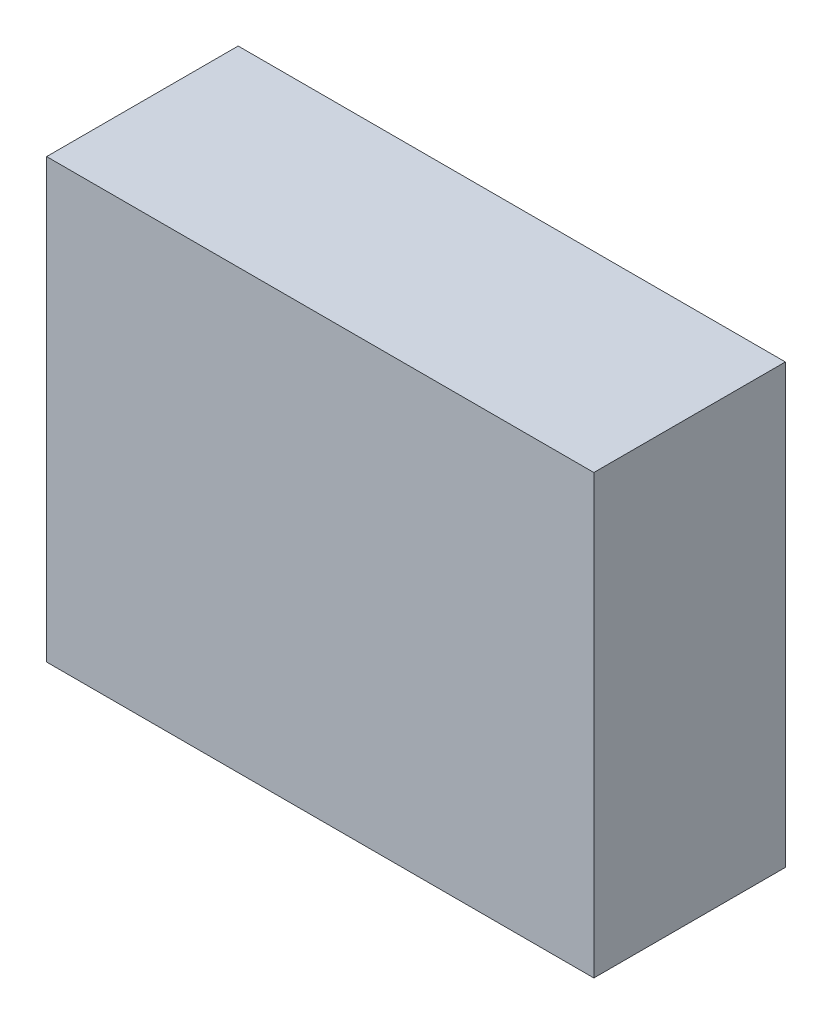
ISO-10303-21;
HEADER;
FILE_DESCRIPTION(('STEP AP214'),'2;1');
FILE_NAME('part.step','',(''),(''),'','','');
FILE_SCHEMA(('AUTOMOTIVE_DESIGN { 1 0 10303 214 1 1 1 1 }'));
ENDSEC;
DATA;
#1=APPLICATION_CONTEXT('core data for automotive mechanical design processes');
#2=APPLICATION_PROTOCOL_DEFINITION('international standard','automotive_design',2000,#1);
#3=PRODUCT_CONTEXT('',#1,'mechanical');
#4=PRODUCT('Part','Part','',(#3));
#5=PRODUCT_RELATED_PRODUCT_CATEGORY('part','',(#4));
#6=PRODUCT_DEFINITION_FORMATION('','',#4);
#7=PRODUCT_DEFINITION_CONTEXT('part definition',#1,'design');
#8=PRODUCT_DEFINITION('design','',#6,#7);
#9=PRODUCT_DEFINITION_SHAPE('','',#8);
#10=(LENGTH_UNIT() NAMED_UNIT(*) SI_UNIT(.MILLI.,.METRE.));
#11=(NAMED_UNIT(*) PLANE_ANGLE_UNIT() SI_UNIT($,.RADIAN.));
#12=(NAMED_UNIT(*) SI_UNIT($,.STERADIAN.) SOLID_ANGLE_UNIT());
#13=UNCERTAINTY_MEASURE_WITH_UNIT(LENGTH_MEASURE(1.E-05),#10,'distance_accuracy_value','');
#14=(GEOMETRIC_REPRESENTATION_CONTEXT(3) GLOBAL_UNCERTAINTY_ASSIGNED_CONTEXT((#13)) GLOBAL_UNIT_ASSIGNED_CONTEXT((#10,
#11,#12)) REPRESENTATION_CONTEXT('',''));
#15=CARTESIAN_POINT('',(0.,0.,0.));
#16=DIRECTION('',(0.,0.,1.));
#17=DIRECTION('',(1.,0.,0.));
#18=AXIS2_PLACEMENT_3D('',#15,#16,#17);
#19=CARTESIAN_POINT('',(2.50000008,2.00000108,1.74999904));
#20=DIRECTION('',(0.,0.,1.));
#21=DIRECTION('',(1.,0.,0.));
#22=AXIS2_PLACEMENT_3D('',#19,#20,#21);
#23=PLANE('',#22);
#24=DIRECTION('',(1.,0.,0.));
#25=VECTOR('',#24,1.);
#26=CARTESIAN_POINT('',(2.50000008,-2.00000108,1.74999904));
#27=LINE('',#26,#25);
#28=CARTESIAN_POINT('',(2.50000008,-2.00000108,1.74999904));
#29=VERTEX_POINT('',#28);
#30=CARTESIAN_POINT('',(-2.50000008,-2.00000108,1.74999904));
#31=VERTEX_POINT('',#30);
#32=EDGE_CURVE('E52',#29,#31,#27,.F.);
#33=ORIENTED_EDGE('',*,*,#32,.F.);
#34=DIRECTION('',(0.,1.,0.));
#35=VECTOR('',#34,1.);
#36=CARTESIAN_POINT('',(2.50000008,2.00000108,1.74999904));
#37=LINE('',#36,#35);
#38=CARTESIAN_POINT('',(2.50000008,2.00000108,1.74999904));
#39=VERTEX_POINT('',#38);
#40=EDGE_CURVE('E67',#39,#29,#37,.F.);
#41=ORIENTED_EDGE('',*,*,#40,.F.);
#42=DIRECTION('',(1.,0.,0.));
#43=VECTOR('',#42,1.);
#44=CARTESIAN_POINT('',(-2.50000008,2.00000108,1.74999904));
#45=LINE('',#44,#43);
#46=CARTESIAN_POINT('',(-2.50000008,2.00000108,1.74999904));
#47=VERTEX_POINT('',#46);
#48=EDGE_CURVE('E19',#47,#39,#45,.T.);
#49=ORIENTED_EDGE('',*,*,#48,.F.);
#50=DIRECTION('',(0.,1.,0.));
#51=VECTOR('',#50,1.);
#52=CARTESIAN_POINT('',(-2.50000008,-2.00000108,1.74999904));
#53=LINE('',#52,#51);
#54=EDGE_CURVE('E57',#31,#47,#53,.T.);
#55=ORIENTED_EDGE('',*,*,#54,.F.);
#56=EDGE_LOOP('',(#33,#41,#49,#55));
#57=FACE_BOUND('',#56,.T.);
#58=ADVANCED_FACE('F16',(#57),#23,.T.);
#59=CARTESIAN_POINT('',(-2.50000008,2.00000108,0.));
#60=DIRECTION('',(0.,1.,0.));
#61=DIRECTION('',(0.,0.,1.));
#62=AXIS2_PLACEMENT_3D('',#59,#60,#61);
#63=PLANE('',#62);
#64=DIRECTION('',(0.,0.,-1.));
#65=VECTOR('',#64,1.);
#66=CARTESIAN_POINT('',(2.50000008,2.00000108,0.));
#67=LINE('',#66,#65);
#68=CARTESIAN_POINT('',(2.50000008,2.00000108,0.));
#69=VERTEX_POINT('',#68);
#70=EDGE_CURVE('E78',#69,#39,#67,.F.);
#71=ORIENTED_EDGE('',*,*,#70,.F.);
#72=DIRECTION('',(1.,0.,0.));
#73=VECTOR('',#72,1.);
#74=CARTESIAN_POINT('',(2.50000008,2.00000108,0.));
#75=LINE('',#74,#73);
#76=CARTESIAN_POINT('',(-2.50000008,2.00000108,0.));
#77=VERTEX_POINT('',#76);
#78=EDGE_CURVE('E73',#69,#77,#75,.F.);
#79=ORIENTED_EDGE('',*,*,#78,.T.);
#80=DIRECTION('',(0.,0.,1.));
#81=VECTOR('',#80,1.);
#82=CARTESIAN_POINT('',(-2.50000008,2.00000108,0.));
#83=LINE('',#82,#81);
#84=EDGE_CURVE('E62',#47,#77,#83,.F.);
#85=ORIENTED_EDGE('',*,*,#84,.F.);
#86=ORIENTED_EDGE('',*,*,#48,.T.);
#87=EDGE_LOOP('',(#71,#79,#85,#86));
#88=FACE_BOUND('',#87,.T.);
#89=ADVANCED_FACE('F72',(#88),#63,.T.);
#90=CARTESIAN_POINT('',(-2.50000008,-2.00000108,0.));
#91=DIRECTION('',(-1.,0.,0.));
#92=DIRECTION('',(0.,0.,1.));
#93=AXIS2_PLACEMENT_3D('',#90,#91,#92);
#94=PLANE('',#93);
#95=ORIENTED_EDGE('',*,*,#84,.T.);
#96=DIRECTION('',(0.,1.,0.));
#97=VECTOR('',#96,1.);
#98=CARTESIAN_POINT('',(-2.50000008,2.00000108,0.));
#99=LINE('',#98,#97);
#100=CARTESIAN_POINT('',(-2.50000008,-2.00000108,0.));
#101=VERTEX_POINT('',#100);
#102=EDGE_CURVE('E83',#77,#101,#99,.F.);
#103=ORIENTED_EDGE('',*,*,#102,.T.);
#104=DIRECTION('',(0.,0.,-1.));
#105=VECTOR('',#104,1.);
#106=CARTESIAN_POINT('',(-2.50000008,-2.00000108,0.));
#107=LINE('',#106,#105);
#108=EDGE_CURVE('E64',#31,#101,#107,.T.);
#109=ORIENTED_EDGE('',*,*,#108,.F.);
#110=ORIENTED_EDGE('',*,*,#54,.T.);
#111=EDGE_LOOP('',(#95,#103,#109,#110));
#112=FACE_BOUND('',#111,.T.);
#113=ADVANCED_FACE('F59',(#112),#94,.T.);
#114=CARTESIAN_POINT('',(2.50000008,-2.00000108,0.));
#115=DIRECTION('',(0.,-1.,0.));
#116=DIRECTION('',(0.,0.,-1.));
#117=AXIS2_PLACEMENT_3D('',#114,#115,#116);
#118=PLANE('',#117);
#119=ORIENTED_EDGE('',*,*,#108,.T.);
#120=DIRECTION('',(1.,0.,0.));
#121=VECTOR('',#120,1.);
#122=CARTESIAN_POINT('',(2.50000008,-2.00000108,0.));
#123=LINE('',#122,#121);
#124=CARTESIAN_POINT('',(2.50000008,-2.00000108,0.));
#125=VERTEX_POINT('',#124);
#126=EDGE_CURVE('E25',#101,#125,#123,.T.);
#127=ORIENTED_EDGE('',*,*,#126,.T.);
#128=DIRECTION('',(0.,0.,-1.));
#129=VECTOR('',#128,1.);
#130=CARTESIAN_POINT('',(2.50000008,-2.00000108,0.));
#131=LINE('',#130,#129);
#132=EDGE_CURVE('E33',#29,#125,#131,.T.);
#133=ORIENTED_EDGE('',*,*,#132,.F.);
#134=ORIENTED_EDGE('',*,*,#32,.T.);
#135=EDGE_LOOP('',(#119,#127,#133,#134));
#136=FACE_BOUND('',#135,.T.);
#137=ADVANCED_FACE('F87',(#136),#118,.T.);
#138=CARTESIAN_POINT('',(2.50000008,2.00000108,0.));
#139=DIRECTION('',(1.,0.,0.));
#140=DIRECTION('',(0.,0.,-1.));
#141=AXIS2_PLACEMENT_3D('',#138,#139,#140);
#142=PLANE('',#141);
#143=ORIENTED_EDGE('',*,*,#132,.T.);
#144=DIRECTION('',(0.,1.,0.));
#145=VECTOR('',#144,1.);
#146=CARTESIAN_POINT('',(2.50000008,2.00000108,0.));
#147=LINE('',#146,#145);
#148=EDGE_CURVE('E10',#125,#69,#147,.T.);
#149=ORIENTED_EDGE('',*,*,#148,.T.);
#150=ORIENTED_EDGE('',*,*,#70,.T.);
#151=ORIENTED_EDGE('',*,*,#40,.T.);
#152=EDGE_LOOP('',(#143,#149,#150,#151));
#153=FACE_BOUND('',#152,.T.);
#154=ADVANCED_FACE('F90',(#153),#142,.T.);
#155=CARTESIAN_POINT('',(2.50000008,2.00000108,0.));
#156=DIRECTION('',(0.,0.,1.));
#157=DIRECTION('',(1.,0.,0.));
#158=AXIS2_PLACEMENT_3D('',#155,#156,#157);
#159=PLANE('',#158);
#160=ORIENTED_EDGE('',*,*,#126,.F.);
#161=ORIENTED_EDGE('',*,*,#102,.F.);
#162=ORIENTED_EDGE('',*,*,#78,.F.);
#163=ORIENTED_EDGE('',*,*,#148,.F.);
#164=EDGE_LOOP('',(#160,#161,#162,#163));
#165=FACE_BOUND('',#164,.T.);
#166=ADVANCED_FACE('F89',(#165),#159,.F.);
#167=CLOSED_SHELL('',(#58,#89,#113,#137,#154,#166));
#168=MANIFOLD_SOLID_BREP('B1',#167);
#169=ADVANCED_BREP_SHAPE_REPRESENTATION('',(#18,#168),#14);
#170=SHAPE_DEFINITION_REPRESENTATION(#9,#169);
ENDSEC;
END-ISO-10303-21;
